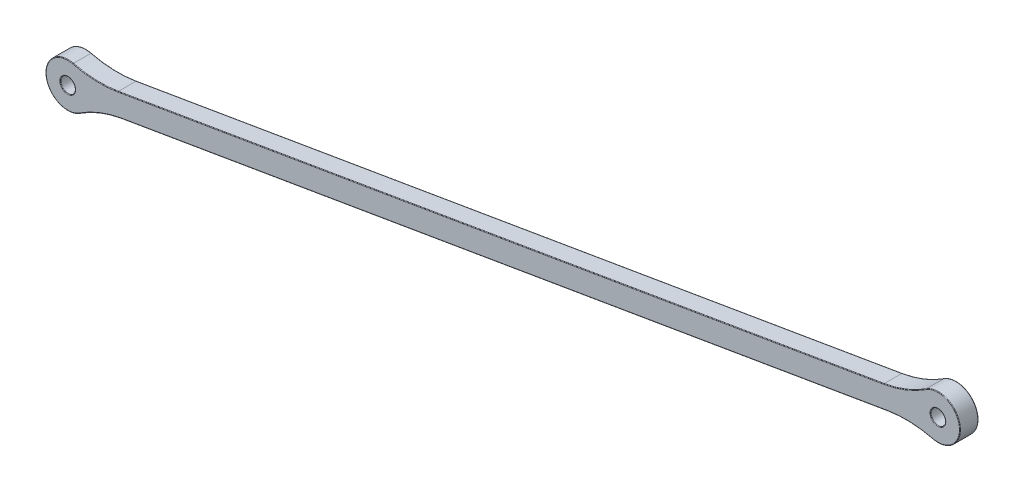
ISO-10303-21;
HEADER;
FILE_DESCRIPTION(('STEP AP214'),'2;1');
FILE_NAME('part.step','',(''),(''),'','','');
FILE_SCHEMA(('AUTOMOTIVE_DESIGN { 1 0 10303 214 1 1 1 1 }'));
ENDSEC;
DATA;
#1=APPLICATION_CONTEXT('core data for automotive mechanical design processes');
#2=APPLICATION_PROTOCOL_DEFINITION('international standard','automotive_design',2000,#1);
#3=PRODUCT_CONTEXT('',#1,'mechanical');
#4=PRODUCT('Part','Part','',(#3));
#5=PRODUCT_RELATED_PRODUCT_CATEGORY('part','',(#4));
#6=PRODUCT_DEFINITION_FORMATION('','',#4);
#7=PRODUCT_DEFINITION_CONTEXT('part definition',#1,'design');
#8=PRODUCT_DEFINITION('design','',#6,#7);
#9=PRODUCT_DEFINITION_SHAPE('','',#8);
#10=(LENGTH_UNIT() NAMED_UNIT(*) SI_UNIT(.MILLI.,.METRE.));
#11=(NAMED_UNIT(*) PLANE_ANGLE_UNIT() SI_UNIT($,.RADIAN.));
#12=(NAMED_UNIT(*) SI_UNIT($,.STERADIAN.) SOLID_ANGLE_UNIT());
#13=UNCERTAINTY_MEASURE_WITH_UNIT(LENGTH_MEASURE(1.E-05),#10,'distance_accuracy_value','');
#14=(GEOMETRIC_REPRESENTATION_CONTEXT(3) GLOBAL_UNCERTAINTY_ASSIGNED_CONTEXT((#13)) GLOBAL_UNIT_ASSIGNED_CONTEXT((#10,
#11,#12)) REPRESENTATION_CONTEXT('',''));
#15=CARTESIAN_POINT('',(0.,0.,0.));
#16=DIRECTION('',(0.,0.,1.));
#17=DIRECTION('',(1.,0.,0.));
#18=AXIS2_PLACEMENT_3D('',#15,#16,#17);
#19=CARTESIAN_POINT('',(-307.976278264637,263.097982683496,-5.));
#20=DIRECTION('',(0.,0.,1.));
#21=DIRECTION('',(1.,0.,0.));
#22=AXIS2_PLACEMENT_3D('',#19,#20,#21);
#23=CYLINDRICAL_SURFACE('',#22,5.99999999999999);
#24=DIRECTION('',(0.,0.,1.));
#25=VECTOR('',#24,1.);
#26=CARTESIAN_POINT('',(-304.692791597338,258.0761587812,-5.));
#27=LINE('',#26,#25);
#28=CARTESIAN_POINT('',(-304.692791597338,258.0761587812,-4.85));
#29=VERTEX_POINT('',#28);
#30=CARTESIAN_POINT('',(-304.692791597338,258.0761587812,-0.15));
#31=VERTEX_POINT('',#30);
#32=EDGE_CURVE('E345',#29,#31,#27,.T.);
#33=ORIENTED_EDGE('',*,*,#32,.T.);
#34=CARTESIAN_POINT('',(-307.976278264637,263.097982683496,-0.15));
#35=DIRECTION('',(0.,0.,1.));
#36=DIRECTION('',(1.,0.,0.));
#37=AXIS2_PLACEMENT_3D('',#34,#35,#36);
#38=CIRCLE('',#37,5.99999999999999);
#39=CARTESIAN_POINT('',(-306.531400647567,268.92141197144,-0.15));
#40=VERTEX_POINT('',#39);
#41=EDGE_CURVE('E219',#31,#40,#38,.F.);
#42=ORIENTED_EDGE('',*,*,#41,.T.);
#43=DIRECTION('',(0.,0.,1.));
#44=VECTOR('',#43,1.);
#45=CARTESIAN_POINT('',(-306.531400647567,268.92141197144,-5.));
#46=LINE('',#45,#44);
#47=CARTESIAN_POINT('',(-306.531400647567,268.92141197144,-4.85));
#48=VERTEX_POINT('',#47);
#49=EDGE_CURVE('E262',#40,#48,#46,.F.);
#50=ORIENTED_EDGE('',*,*,#49,.T.);
#51=CARTESIAN_POINT('',(-307.976278264637,263.097982683496,-4.85));
#52=DIRECTION('',(0.,0.,1.));
#53=DIRECTION('',(1.,0.,0.));
#54=AXIS2_PLACEMENT_3D('',#51,#52,#53);
#55=CIRCLE('',#54,5.99999999999999);
#56=EDGE_CURVE('E217',#48,#29,#55,.T.);
#57=ORIENTED_EDGE('',*,*,#56,.T.);
#58=EDGE_LOOP('',(#33,#42,#50,#57));
#59=FACE_BOUND('',#58,.T.);
#60=ADVANCED_FACE('F39',(#59),#23,.T.);
#61=CARTESIAN_POINT('',(-52.4628434174486,309.458293959367,-5.));
#62=DIRECTION('',(0.167146277293557,-0.985932108203656,0.));
#63=DIRECTION('',(0.985932108203656,0.167146277293557,0.));
#64=AXIS2_PLACEMENT_3D('',#61,#62,#63);
#65=PLANE('',#64);
#66=DIRECTION('',(0.,0.,1.));
#67=VECTOR('',#66,1.);
#68=CARTESIAN_POINT('',(-294.29262424341,268.460595165053,-5.));
#69=LINE('',#68,#67);
#70=CARTESIAN_POINT('',(-294.29262424341,268.460595165053,-4.85));
#71=VERTEX_POINT('',#70);
#72=CARTESIAN_POINT('',(-294.29262424341,268.460595165053,-0.15));
#73=VERTEX_POINT('',#72);
#74=EDGE_CURVE('E307',#71,#73,#69,.T.);
#75=ORIENTED_EDGE('',*,*,#74,.T.);
#76=DIRECTION('',(0.985932108203656,0.167146277293557,0.));
#77=VECTOR('',#76,1.);
#78=CARTESIAN_POINT('',(-86.0391039807482,303.766069401614,-0.15));
#79=LINE('',#78,#77);
#80=CARTESIAN_POINT('',(-86.0391039807482,303.766069401614,-0.15));
#81=VERTEX_POINT('',#80);
#82=EDGE_CURVE('E227',#73,#81,#79,.T.);
#83=ORIENTED_EDGE('',*,*,#82,.T.);
#84=DIRECTION('',(0.,0.,1.));
#85=VECTOR('',#84,1.);
#86=CARTESIAN_POINT('',(-86.0391039807482,303.766069401614,-5.));
#87=LINE('',#86,#85);
#88=CARTESIAN_POINT('',(-86.0391039807482,303.766069401614,-4.85));
#89=VERTEX_POINT('',#88);
#90=EDGE_CURVE('E299',#81,#89,#87,.F.);
#91=ORIENTED_EDGE('',*,*,#90,.T.);
#92=DIRECTION('',(0.985932108203656,0.167146277293557,0.));
#93=VECTOR('',#92,1.);
#94=CARTESIAN_POINT('',(-52.4628434174486,309.458293959367,-4.85));
#95=LINE('',#94,#93);
#96=EDGE_CURVE('E225',#89,#71,#95,.F.);
#97=ORIENTED_EDGE('',*,*,#96,.T.);
#98=EDGE_LOOP('',(#75,#83,#91,#97));
#99=FACE_BOUND('',#98,.T.);
#100=ADVANCED_FACE('F304',(#99),#65,.F.);
#101=CARTESIAN_POINT('',(-71.3525722957598,303.213089233949,-5.));
#102=DIRECTION('',(0.,0.,1.));
#103=DIRECTION('',(1.,0.,0.));
#104=AXIS2_PLACEMENT_3D('',#101,#102,#103);
#105=CYLINDRICAL_SURFACE('',#104,6.);
#106=DIRECTION('',(0.,0.,1.));
#107=VECTOR('',#106,1.);
#108=CARTESIAN_POINT('',(-74.636058963059,308.234913136245,-5.));
#109=LINE('',#108,#107);
#110=CARTESIAN_POINT('',(-74.636058963059,308.234913136245,-4.85));
#111=VERTEX_POINT('',#110);
#112=CARTESIAN_POINT('',(-74.636058963059,308.234913136245,-0.15));
#113=VERTEX_POINT('',#112);
#114=EDGE_CURVE('E301',#111,#113,#109,.T.);
#115=ORIENTED_EDGE('',*,*,#114,.T.);
#116=CARTESIAN_POINT('',(-71.3525722957598,303.213089233949,-0.15));
#117=DIRECTION('',(0.,0.,1.));
#118=DIRECTION('',(1.,0.,0.));
#119=AXIS2_PLACEMENT_3D('',#116,#117,#118);
#120=CIRCLE('',#119,6.);
#121=CARTESIAN_POINT('',(-72.7974499128298,297.389659946005,-0.15));
#122=VERTEX_POINT('',#121);
#123=EDGE_CURVE('E202',#113,#122,#120,.F.);
#124=ORIENTED_EDGE('',*,*,#123,.T.);
#125=DIRECTION('',(0.,0.,1.));
#126=VECTOR('',#125,1.);
#127=CARTESIAN_POINT('',(-72.7974499128298,297.389659946005,-5.));
#128=LINE('',#127,#126);
#129=CARTESIAN_POINT('',(-72.7974499128298,297.389659946005,-4.85));
#130=VERTEX_POINT('',#129);
#131=EDGE_CURVE('E311',#122,#130,#128,.F.);
#132=ORIENTED_EDGE('',*,*,#131,.T.);
#133=CARTESIAN_POINT('',(-71.3525722957598,303.213089233949,-4.85));
#134=DIRECTION('',(0.,0.,1.));
#135=DIRECTION('',(1.,0.,0.));
#136=AXIS2_PLACEMENT_3D('',#133,#134,#135);
#137=CIRCLE('',#136,6.);
#138=EDGE_CURVE('E200',#130,#111,#137,.T.);
#139=ORIENTED_EDGE('',*,*,#138,.T.);
#140=EDGE_LOOP('',(#115,#124,#132,#139));
#141=FACE_BOUND('',#140,.T.);
#142=ADVANCED_FACE('F336',(#141),#105,.T.);
#143=CARTESIAN_POINT('',(-307.976278264637,263.097982683496,-5.));
#144=DIRECTION('',(0.,0.,1.));
#145=DIRECTION('',(1.,0.,0.));
#146=AXIS2_PLACEMENT_3D('',#143,#144,#145);
#147=CYLINDRICAL_SURFACE('',#146,2.);
#148=CARTESIAN_POINT('',(-307.976278264637,263.097982683496,-0.15));
#149=DIRECTION('',(0.,0.,1.));
#150=DIRECTION('',(1.,0.,0.));
#151=AXIS2_PLACEMENT_3D('',#148,#149,#150);
#152=CIRCLE('',#151,2.);
#153=CARTESIAN_POINT('',(-305.976278264637,263.097982683496,-0.15));
#154=VERTEX_POINT('',#153);
#155=EDGE_CURVE('E194',#154,#154,#152,.T.);
#156=ORIENTED_EDGE('',*,*,#155,.T.);
#157=EDGE_LOOP('',(#156));
#158=FACE_BOUND('',#157,.T.);
#159=CARTESIAN_POINT('',(-307.976278264637,263.097982683496,-4.85));
#160=DIRECTION('',(0.,0.,1.));
#161=DIRECTION('',(1.,0.,0.));
#162=AXIS2_PLACEMENT_3D('',#159,#160,#161);
#163=CIRCLE('',#162,2.);
#164=CARTESIAN_POINT('',(-305.976278264637,263.097982683496,-4.85));
#165=VERTEX_POINT('',#164);
#166=EDGE_CURVE('E191',#165,#165,#163,.F.);
#167=ORIENTED_EDGE('',*,*,#166,.T.);
#168=EDGE_LOOP('',(#167));
#169=FACE_BOUND('',#168,.T.);
#170=ADVANCED_FACE('F643',(#158,#169),#147,.F.);
#171=CARTESIAN_POINT('',(-51.4599657536872,303.542701310145,-5.));
#172=DIRECTION('',(0.167146277293557,-0.985932108203656,0.));
#173=DIRECTION('',(0.985932108203656,0.167146277293557,0.));
#174=AXIS2_PLACEMENT_3D('',#171,#172,#173);
#175=PLANE('',#174);
#176=DIRECTION('',(0.,0.,-1.));
#177=VECTOR('',#176,1.);
#178=CARTESIAN_POINT('',(-85.0362263169865,297.850476752392,0.));
#179=LINE('',#178,#177);
#180=CARTESIAN_POINT('',(-85.0362263169865,297.850476752392,-4.85));
#181=VERTEX_POINT('',#180);
#182=CARTESIAN_POINT('',(-85.0362263169865,297.850476752392,-0.15));
#183=VERTEX_POINT('',#182);
#184=EDGE_CURVE('E340',#181,#183,#179,.F.);
#185=ORIENTED_EDGE('',*,*,#184,.T.);
#186=DIRECTION('',(0.985932108203656,0.167146277293557,0.));
#187=VECTOR('',#186,1.);
#188=CARTESIAN_POINT('',(-51.4599657536872,303.542701310145,-0.15));
#189=LINE('',#188,#187);
#190=CARTESIAN_POINT('',(-293.289746579649,262.545002515831,-0.15));
#191=VERTEX_POINT('',#190);
#192=EDGE_CURVE('E210',#183,#191,#189,.F.);
#193=ORIENTED_EDGE('',*,*,#192,.T.);
#194=DIRECTION('',(0.,0.,-1.));
#195=VECTOR('',#194,1.);
#196=CARTESIAN_POINT('',(-293.289746579649,262.545002515831,-5.));
#197=LINE('',#196,#195);
#198=CARTESIAN_POINT('',(-293.289746579649,262.545002515831,-4.85));
#199=VERTEX_POINT('',#198);
#200=EDGE_CURVE('E337',#191,#199,#197,.T.);
#201=ORIENTED_EDGE('',*,*,#200,.T.);
#202=DIRECTION('',(0.985932108203656,0.167146277293557,0.));
#203=VECTOR('',#202,1.);
#204=CARTESIAN_POINT('',(-85.0362263169865,297.850476752392,-4.85));
#205=LINE('',#204,#203);
#206=EDGE_CURVE('E208',#199,#181,#205,.T.);
#207=ORIENTED_EDGE('',*,*,#206,.T.);
#208=EDGE_LOOP('',(#185,#193,#201,#207));
#209=FACE_BOUND('',#208,.T.);
#210=ADVANCED_FACE('F375',(#209),#175,.T.);
#211=CARTESIAN_POINT('',(-71.3525722957598,303.213089233949,-5.));
#212=DIRECTION('',(0.,0.,1.));
#213=DIRECTION('',(1.,0.,0.));
#214=AXIS2_PLACEMENT_3D('',#211,#212,#213);
#215=CYLINDRICAL_SURFACE('',#214,2.);
#216=CARTESIAN_POINT('',(-71.3525722957598,303.213089233949,-0.15));
#217=DIRECTION('',(0.,0.,1.));
#218=DIRECTION('',(1.,0.,0.));
#219=AXIS2_PLACEMENT_3D('',#216,#217,#218);
#220=CIRCLE('',#219,2.);
#221=CARTESIAN_POINT('',(-69.3525722957598,303.213089233949,-0.15));
#222=VERTEX_POINT('',#221);
#223=EDGE_CURVE('E174',#222,#222,#220,.T.);
#224=ORIENTED_EDGE('',*,*,#223,.T.);
#225=EDGE_LOOP('',(#224));
#226=FACE_BOUND('',#225,.T.);
#227=CARTESIAN_POINT('',(-71.3525722957598,303.213089233949,-4.85));
#228=DIRECTION('',(0.,0.,1.));
#229=DIRECTION('',(1.,0.,0.));
#230=AXIS2_PLACEMENT_3D('',#227,#228,#229);
#231=CIRCLE('',#230,2.);
#232=CARTESIAN_POINT('',(-69.3525722957598,303.213089233949,-4.85));
#233=VERTEX_POINT('',#232);
#234=EDGE_CURVE('E306',#233,#233,#231,.F.);
#235=ORIENTED_EDGE('',*,*,#234,.T.);
#236=EDGE_LOOP('',(#235));
#237=FACE_BOUND('',#236,.T.);
#238=ADVANCED_FACE('F621',(#226,#237),#215,.F.);
#239=CARTESIAN_POINT('',(0.,0.,-5.));
#240=DIRECTION('',(0.,0.,1.));
#241=DIRECTION('',(1.,0.,0.));
#242=AXIS2_PLACEMENT_3D('',#239,#240,#241);
#243=PLANE('',#242);
#244=CARTESIAN_POINT('',(-71.3525722957598,303.213089233949,-5.));
#245=DIRECTION('',(0.,0.,1.));
#246=DIRECTION('',(1.,0.,0.));
#247=AXIS2_PLACEMENT_3D('',#244,#245,#246);
#248=CIRCLE('',#247,2.15);
#249=CARTESIAN_POINT('',(-69.2025722957598,303.213089233949,-5.));
#250=VERTEX_POINT('',#249);
#251=EDGE_CURVE('E11',#250,#250,#248,.T.);
#252=ORIENTED_EDGE('',*,*,#251,.T.);
#253=EDGE_LOOP('',(#252));
#254=FACE_BOUND('',#253,.T.);
#255=CARTESIAN_POINT('',(-307.976278264637,263.097982683496,-5.));
#256=DIRECTION('',(0.,0.,1.));
#257=DIRECTION('',(1.,0.,0.));
#258=AXIS2_PLACEMENT_3D('',#255,#256,#257);
#259=CIRCLE('',#258,2.15);
#260=CARTESIAN_POINT('',(-305.826278264637,263.097982683496,-5.));
#261=VERTEX_POINT('',#260);
#262=EDGE_CURVE('E48',#261,#261,#259,.T.);
#263=ORIENTED_EDGE('',*,*,#262,.T.);
#264=EDGE_LOOP('',(#263));
#265=FACE_BOUND('',#264,.T.);
#266=DIRECTION('',(0.985932108203656,0.167146277293557,0.));
#267=VECTOR('',#266,1.);
#268=CARTESIAN_POINT('',(-293.314818521243,262.692892332062,-5.));
#269=LINE('',#268,#267);
#270=CARTESIAN_POINT('',(-85.0612982585805,297.998366568622,-5.));
#271=VERTEX_POINT('',#270);
#272=CARTESIAN_POINT('',(-293.314818521243,262.692892332062,-5.));
#273=VERTEX_POINT('',#272);
#274=EDGE_CURVE('E56',#271,#273,#269,.F.);
#275=ORIENTED_EDGE('',*,*,#274,.T.);
#276=CARTESIAN_POINT('',(-288.275358260842,232.967039269721,-5.));
#277=DIRECTION('',(0.,0.,1.));
#278=DIRECTION('',(1.,0.,0.));
#279=AXIS2_PLACEMENT_3D('',#276,#277,#278);
#280=CIRCLE('',#279,30.15);
#281=CARTESIAN_POINT('',(-304.774878764021,258.201704378757,-5.));
#282=VERTEX_POINT('',#281);
#283=EDGE_CURVE('E241',#273,#282,#280,.T.);
#284=ORIENTED_EDGE('',*,*,#283,.T.);
#285=CARTESIAN_POINT('',(-307.976278264637,263.097982683496,-5.));
#286=DIRECTION('',(0.,0.,1.));
#287=DIRECTION('',(1.,0.,0.));
#288=AXIS2_PLACEMENT_3D('',#285,#286,#287);
#289=CIRCLE('',#288,5.84999999999999);
#290=CARTESIAN_POINT('',(-306.567522587994,268.775826239242,-5.));
#291=VERTEX_POINT('',#290);
#292=EDGE_CURVE('E229',#282,#291,#289,.F.);
#293=ORIENTED_EDGE('',*,*,#292,.T.);
#294=CARTESIAN_POINT('',(-299.307012562217,298.038558411163,-5.));
#295=DIRECTION('',(0.,0.,1.));
#296=DIRECTION('',(1.,0.,0.));
#297=AXIS2_PLACEMENT_3D('',#294,#295,#296);
#298=CIRCLE('',#297,30.15);
#299=CARTESIAN_POINT('',(-294.267552301816,268.312705348823,-5.));
#300=VERTEX_POINT('',#299);
#301=EDGE_CURVE('E231',#291,#300,#298,.T.);
#302=ORIENTED_EDGE('',*,*,#301,.T.);
#303=DIRECTION('',(0.985932108203656,0.167146277293557,0.));
#304=VECTOR('',#303,1.);
#305=CARTESIAN_POINT('',(-52.4377714758546,309.310404143136,-5.));
#306=LINE('',#305,#304);
#307=CARTESIAN_POINT('',(-86.0140320391542,303.618179585383,-5.));
#308=VERTEX_POINT('',#307);
#309=EDGE_CURVE('E233',#300,#308,#306,.T.);
#310=ORIENTED_EDGE('',*,*,#309,.T.);
#311=CARTESIAN_POINT('',(-91.0534922995549,333.344032647724,-5.));
#312=DIRECTION('',(0.,0.,1.));
#313=DIRECTION('',(1.,0.,0.));
#314=AXIS2_PLACEMENT_3D('',#311,#312,#313);
#315=CIRCLE('',#314,30.15);
#316=CARTESIAN_POINT('',(-74.5539717963765,308.109367538688,-5.));
#317=VERTEX_POINT('',#316);
#318=EDGE_CURVE('E235',#308,#317,#315,.T.);
#319=ORIENTED_EDGE('',*,*,#318,.T.);
#320=CARTESIAN_POINT('',(-71.3525722957598,303.213089233949,-5.));
#321=DIRECTION('',(0.,0.,1.));
#322=DIRECTION('',(1.,0.,0.));
#323=AXIS2_PLACEMENT_3D('',#320,#321,#322);
#324=CIRCLE('',#323,5.85);
#325=CARTESIAN_POINT('',(-72.761327972403,297.535245678204,-5.));
#326=VERTEX_POINT('',#325);
#327=EDGE_CURVE('E237',#317,#326,#324,.F.);
#328=ORIENTED_EDGE('',*,*,#327,.T.);
#329=CARTESIAN_POINT('',(-80.0218379981798,268.272513506282,-5.));
#330=DIRECTION('',(0.,0.,1.));
#331=DIRECTION('',(1.,0.,0.));
#332=AXIS2_PLACEMENT_3D('',#329,#330,#331);
#333=CIRCLE('',#332,30.15);
#334=EDGE_CURVE('E61',#326,#271,#333,.T.);
#335=ORIENTED_EDGE('',*,*,#334,.T.);
#336=EDGE_LOOP('',(#275,#284,#293,#302,#310,#319,#328,#335));
#337=FACE_BOUND('',#336,.T.);
#338=ADVANCED_FACE('F394',(#254,#265,#337),#243,.F.);
#339=CARTESIAN_POINT('',(0.,0.,0.));
#340=DIRECTION('',(0.,0.,1.));
#341=DIRECTION('',(1.,0.,0.));
#342=AXIS2_PLACEMENT_3D('',#339,#340,#341);
#343=PLANE('',#342);
#344=CARTESIAN_POINT('',(-71.3525722957598,303.213089233949,0.));
#345=DIRECTION('',(0.,0.,1.));
#346=DIRECTION('',(1.,0.,0.));
#347=AXIS2_PLACEMENT_3D('',#344,#345,#346);
#348=CIRCLE('',#347,2.15);
#349=CARTESIAN_POINT('',(-69.2025722957598,303.213089233949,0.));
#350=VERTEX_POINT('',#349);
#351=EDGE_CURVE('E183',#350,#350,#348,.F.);
#352=ORIENTED_EDGE('',*,*,#351,.T.);
#353=EDGE_LOOP('',(#352));
#354=FACE_BOUND('',#353,.T.);
#355=CARTESIAN_POINT('',(-307.976278264637,263.097982683496,0.));
#356=DIRECTION('',(0.,0.,1.));
#357=DIRECTION('',(1.,0.,0.));
#358=AXIS2_PLACEMENT_3D('',#355,#356,#357);
#359=CIRCLE('',#358,2.15);
#360=CARTESIAN_POINT('',(-305.826278264637,263.097982683496,0.));
#361=VERTEX_POINT('',#360);
#362=EDGE_CURVE('E180',#361,#361,#359,.F.);
#363=ORIENTED_EDGE('',*,*,#362,.T.);
#364=EDGE_LOOP('',(#363));
#365=FACE_BOUND('',#364,.T.);
#366=CARTESIAN_POINT('',(-71.3525722957598,303.213089233949,0.));
#367=DIRECTION('',(0.,0.,1.));
#368=DIRECTION('',(1.,0.,0.));
#369=AXIS2_PLACEMENT_3D('',#366,#367,#368);
#370=CIRCLE('',#369,5.85);
#371=CARTESIAN_POINT('',(-72.761327972403,297.535245678204,0.));
#372=VERTEX_POINT('',#371);
#373=CARTESIAN_POINT('',(-74.5539717963765,308.109367538688,0.));
#374=VERTEX_POINT('',#373);
#375=EDGE_CURVE('E178',#372,#374,#370,.T.);
#376=ORIENTED_EDGE('',*,*,#375,.T.);
#377=CARTESIAN_POINT('',(-91.0534922995549,333.344032647724,0.));
#378=DIRECTION('',(0.,0.,1.));
#379=DIRECTION('',(1.,0.,0.));
#380=AXIS2_PLACEMENT_3D('',#377,#378,#379);
#381=CIRCLE('',#380,30.15);
#382=CARTESIAN_POINT('',(-86.0140320391542,303.618179585383,0.));
#383=VERTEX_POINT('',#382);
#384=EDGE_CURVE('E159',#374,#383,#381,.F.);
#385=ORIENTED_EDGE('',*,*,#384,.T.);
#386=DIRECTION('',(0.985932108203656,0.167146277293557,0.));
#387=VECTOR('',#386,1.);
#388=CARTESIAN_POINT('',(-294.267552301816,268.312705348823,0.));
#389=LINE('',#388,#387);
#390=CARTESIAN_POINT('',(-294.267552301816,268.312705348823,0.));
#391=VERTEX_POINT('',#390);
#392=EDGE_CURVE('E167',#383,#391,#389,.F.);
#393=ORIENTED_EDGE('',*,*,#392,.T.);
#394=CARTESIAN_POINT('',(-299.307012562217,298.038558411163,0.));
#395=DIRECTION('',(0.,0.,1.));
#396=DIRECTION('',(1.,0.,0.));
#397=AXIS2_PLACEMENT_3D('',#394,#395,#396);
#398=CIRCLE('',#397,30.15);
#399=CARTESIAN_POINT('',(-306.567522587994,268.775826239242,0.));
#400=VERTEX_POINT('',#399);
#401=EDGE_CURVE('E173',#391,#400,#398,.F.);
#402=ORIENTED_EDGE('',*,*,#401,.T.);
#403=CARTESIAN_POINT('',(-307.976278264637,263.097982683496,0.));
#404=DIRECTION('',(0.,0.,1.));
#405=DIRECTION('',(1.,0.,0.));
#406=AXIS2_PLACEMENT_3D('',#403,#404,#405);
#407=CIRCLE('',#406,5.84999999999999);
#408=CARTESIAN_POINT('',(-304.774878764021,258.201704378757,0.));
#409=VERTEX_POINT('',#408);
#410=EDGE_CURVE('E318',#400,#409,#407,.T.);
#411=ORIENTED_EDGE('',*,*,#410,.T.);
#412=CARTESIAN_POINT('',(-288.275358260842,232.967039269721,0.));
#413=DIRECTION('',(0.,0.,1.));
#414=DIRECTION('',(1.,0.,0.));
#415=AXIS2_PLACEMENT_3D('',#412,#413,#414);
#416=CIRCLE('',#415,30.15);
#417=CARTESIAN_POINT('',(-293.314818521243,262.692892332062,0.));
#418=VERTEX_POINT('',#417);
#419=EDGE_CURVE('E320',#409,#418,#416,.F.);
#420=ORIENTED_EDGE('',*,*,#419,.T.);
#421=DIRECTION('',(0.985932108203656,0.167146277293557,0.));
#422=VECTOR('',#421,1.);
#423=CARTESIAN_POINT('',(-51.4850376952813,303.690591126375,0.));
#424=LINE('',#423,#422);
#425=CARTESIAN_POINT('',(-85.0612982585805,297.998366568622,0.));
#426=VERTEX_POINT('',#425);
#427=EDGE_CURVE('E322',#418,#426,#424,.T.);
#428=ORIENTED_EDGE('',*,*,#427,.T.);
#429=CARTESIAN_POINT('',(-80.0218379981798,268.272513506282,0.));
#430=DIRECTION('',(0.,0.,1.));
#431=DIRECTION('',(1.,0.,0.));
#432=AXIS2_PLACEMENT_3D('',#429,#430,#431);
#433=CIRCLE('',#432,30.15);
#434=EDGE_CURVE('E185',#426,#372,#433,.F.);
#435=ORIENTED_EDGE('',*,*,#434,.T.);
#436=EDGE_LOOP('',(#376,#385,#393,#402,#411,#420,#428,#435));
#437=FACE_BOUND('',#436,.T.);
#438=ADVANCED_FACE('F176',(#354,#365,#437),#343,.T.);
#439=CARTESIAN_POINT('',(-288.275358260842,232.967039269721,-5.));
#440=DIRECTION('',(0.,0.,1.));
#441=DIRECTION('',(1.,0.,0.));
#442=AXIS2_PLACEMENT_3D('',#439,#440,#441);
#443=CYLINDRICAL_SURFACE('',#442,30.);
#444=ORIENTED_EDGE('',*,*,#200,.F.);
#445=CARTESIAN_POINT('',(-288.275358260842,232.967039269721,-0.15));
#446=DIRECTION('',(0.,0.,1.));
#447=DIRECTION('',(1.,0.,0.));
#448=AXIS2_PLACEMENT_3D('',#445,#446,#447);
#449=CIRCLE('',#448,30.);
#450=EDGE_CURVE('E215',#191,#31,#449,.T.);
#451=ORIENTED_EDGE('',*,*,#450,.T.);
#452=ORIENTED_EDGE('',*,*,#32,.F.);
#453=CARTESIAN_POINT('',(-288.275358260842,232.967039269721,-4.85));
#454=DIRECTION('',(0.,0.,1.));
#455=DIRECTION('',(1.,0.,0.));
#456=AXIS2_PLACEMENT_3D('',#453,#454,#455);
#457=CIRCLE('',#456,30.);
#458=EDGE_CURVE('E212',#29,#199,#457,.F.);
#459=ORIENTED_EDGE('',*,*,#458,.T.);
#460=EDGE_LOOP('',(#444,#451,#452,#459));
#461=FACE_BOUND('',#460,.T.);
#462=ADVANCED_FACE('F372',(#461),#443,.F.);
#463=CARTESIAN_POINT('',(-80.0218379981798,268.272513506282,-5.));
#464=DIRECTION('',(0.,0.,1.));
#465=DIRECTION('',(1.,0.,0.));
#466=AXIS2_PLACEMENT_3D('',#463,#464,#465);
#467=CYLINDRICAL_SURFACE('',#466,30.);
#468=ORIENTED_EDGE('',*,*,#131,.F.);
#469=CARTESIAN_POINT('',(-80.0218379981798,268.272513506282,-0.15));
#470=DIRECTION('',(0.,0.,1.));
#471=DIRECTION('',(1.,0.,0.));
#472=AXIS2_PLACEMENT_3D('',#469,#470,#471);
#473=CIRCLE('',#472,30.);
#474=EDGE_CURVE('E206',#122,#183,#473,.T.);
#475=ORIENTED_EDGE('',*,*,#474,.T.);
#476=ORIENTED_EDGE('',*,*,#184,.F.);
#477=CARTESIAN_POINT('',(-80.0218379981798,268.272513506282,-4.85));
#478=DIRECTION('',(0.,0.,1.));
#479=DIRECTION('',(1.,0.,0.));
#480=AXIS2_PLACEMENT_3D('',#477,#478,#479);
#481=CIRCLE('',#480,30.);
#482=EDGE_CURVE('E204',#181,#130,#481,.F.);
#483=ORIENTED_EDGE('',*,*,#482,.T.);
#484=EDGE_LOOP('',(#468,#475,#476,#483));
#485=FACE_BOUND('',#484,.T.);
#486=ADVANCED_FACE('F419',(#485),#467,.F.);
#487=CARTESIAN_POINT('',(-91.0534922995549,333.344032647724,-5.));
#488=DIRECTION('',(0.,0.,1.));
#489=DIRECTION('',(1.,0.,0.));
#490=AXIS2_PLACEMENT_3D('',#487,#488,#489);
#491=CYLINDRICAL_SURFACE('',#490,30.);
#492=ORIENTED_EDGE('',*,*,#90,.F.);
#493=CARTESIAN_POINT('',(-91.0534922995549,333.344032647724,-0.15));
#494=DIRECTION('',(0.,0.,1.));
#495=DIRECTION('',(1.,0.,0.));
#496=AXIS2_PLACEMENT_3D('',#493,#494,#495);
#497=CIRCLE('',#496,30.);
#498=EDGE_CURVE('E161',#81,#113,#497,.T.);
#499=ORIENTED_EDGE('',*,*,#498,.T.);
#500=ORIENTED_EDGE('',*,*,#114,.F.);
#501=CARTESIAN_POINT('',(-91.0534922995549,333.344032647724,-4.85));
#502=DIRECTION('',(0.,0.,1.));
#503=DIRECTION('',(1.,0.,0.));
#504=AXIS2_PLACEMENT_3D('',#501,#502,#503);
#505=CIRCLE('',#504,30.);
#506=EDGE_CURVE('E197',#111,#89,#505,.F.);
#507=ORIENTED_EDGE('',*,*,#506,.T.);
#508=EDGE_LOOP('',(#492,#499,#500,#507));
#509=FACE_BOUND('',#508,.T.);
#510=ADVANCED_FACE('F298',(#509),#491,.F.);
#511=CARTESIAN_POINT('',(-299.307012562217,298.038558411163,-5.));
#512=DIRECTION('',(0.,0.,1.));
#513=DIRECTION('',(1.,0.,0.));
#514=AXIS2_PLACEMENT_3D('',#511,#512,#513);
#515=CYLINDRICAL_SURFACE('',#514,30.);
#516=ORIENTED_EDGE('',*,*,#49,.F.);
#517=CARTESIAN_POINT('',(-299.307012562217,298.038558411163,-0.15));
#518=DIRECTION('',(0.,0.,1.));
#519=DIRECTION('',(1.,0.,0.));
#520=AXIS2_PLACEMENT_3D('',#517,#518,#519);
#521=CIRCLE('',#520,30.);
#522=EDGE_CURVE('E223',#40,#73,#521,.T.);
#523=ORIENTED_EDGE('',*,*,#522,.T.);
#524=ORIENTED_EDGE('',*,*,#74,.F.);
#525=CARTESIAN_POINT('',(-299.307012562217,298.038558411163,-4.85));
#526=DIRECTION('',(0.,0.,1.));
#527=DIRECTION('',(1.,0.,0.));
#528=AXIS2_PLACEMENT_3D('',#525,#526,#527);
#529=CIRCLE('',#528,30.);
#530=EDGE_CURVE('E221',#71,#48,#529,.F.);
#531=ORIENTED_EDGE('',*,*,#530,.T.);
#532=EDGE_LOOP('',(#516,#523,#524,#531));
#533=FACE_BOUND('',#532,.T.);
#534=ADVANCED_FACE('F391',(#533),#515,.F.);
#535=CARTESIAN_POINT('',(-71.3525722957598,303.213089233949,-0.15));
#536=DIRECTION('',(0.,0.,1.));
#537=DIRECTION('',(1.,0.,0.));
#538=AXIS2_PLACEMENT_3D('',#535,#536,#537);
#539=TOROIDAL_SURFACE('',#538,2.15,0.15);
#540=ORIENTED_EDGE('',*,*,#351,.F.);
#541=EDGE_LOOP('',(#540));
#542=FACE_BOUND('',#541,.T.);
#543=ORIENTED_EDGE('',*,*,#223,.F.);
#544=EDGE_LOOP('',(#543));
#545=FACE_BOUND('',#544,.T.);
#546=ADVANCED_FACE('F427',(#542,#545),#539,.T.);
#547=CARTESIAN_POINT('',(-307.976278264637,263.097982683496,-0.15));
#548=DIRECTION('',(0.,0.,1.));
#549=DIRECTION('',(1.,0.,0.));
#550=AXIS2_PLACEMENT_3D('',#547,#548,#549);
#551=TOROIDAL_SURFACE('',#550,2.15,0.15);
#552=ORIENTED_EDGE('',*,*,#362,.F.);
#553=EDGE_LOOP('',(#552));
#554=FACE_BOUND('',#553,.T.);
#555=ORIENTED_EDGE('',*,*,#155,.F.);
#556=EDGE_LOOP('',(#555));
#557=FACE_BOUND('',#556,.T.);
#558=ADVANCED_FACE('F430',(#554,#557),#551,.T.);
#559=CARTESIAN_POINT('',(-288.275358260842,232.967039269721,-0.15));
#560=DIRECTION('',(0.,0.,1.));
#561=DIRECTION('',(1.,0.,0.));
#562=AXIS2_PLACEMENT_3D('',#559,#560,#561);
#563=TOROIDAL_SURFACE('',#562,30.15,0.15);
#564=CARTESIAN_POINT('',(-304.774878764021,258.201704378757,-0.15));
#565=DIRECTION('',(-0.836970650382705,-0.547247777883065,0.));
#566=DIRECTION('',(0.547247777883065,-0.836970650382705,0.));
#567=AXIS2_PLACEMENT_3D('',#564,#565,#566);
#568=CIRCLE('',#567,0.15);
#569=EDGE_CURVE('E256',#31,#409,#568,.T.);
#570=ORIENTED_EDGE('',*,*,#569,.F.);
#571=ORIENTED_EDGE('',*,*,#450,.F.);
#572=CARTESIAN_POINT('',(-293.314818521243,262.692892332062,-0.15));
#573=DIRECTION('',(0.985932108203677,0.167146277293431,0.));
#574=DIRECTION('',(-0.167146277293431,0.985932108203677,0.));
#575=AXIS2_PLACEMENT_3D('',#572,#573,#574);
#576=CIRCLE('',#575,0.15);
#577=EDGE_CURVE('E259',#418,#191,#576,.T.);
#578=ORIENTED_EDGE('',*,*,#577,.F.);
#579=ORIENTED_EDGE('',*,*,#419,.F.);
#580=EDGE_LOOP('',(#570,#571,#578,#579));
#581=FACE_BOUND('',#580,.T.);
#582=ADVANCED_FACE('F384',(#581),#563,.T.);
#583=CARTESIAN_POINT('',(-51.4850376952813,303.690591126375,-0.15));
#584=DIRECTION('',(0.985932108203656,0.167146277293557,0.));
#585=DIRECTION('',(-0.167146277293557,0.985932108203656,0.));
#586=AXIS2_PLACEMENT_3D('',#583,#584,#585);
#587=CYLINDRICAL_SURFACE('',#586,0.15);
#588=ORIENTED_EDGE('',*,*,#577,.T.);
#589=ORIENTED_EDGE('',*,*,#192,.F.);
#590=CARTESIAN_POINT('',(-85.0612982585805,297.998366568622,-0.15));
#591=DIRECTION('',(0.985932108203647,0.167146277293611,0.));
#592=DIRECTION('',(-0.167146277293611,0.985932108203647,0.));
#593=AXIS2_PLACEMENT_3D('',#590,#591,#592);
#594=CIRCLE('',#593,0.15);
#595=EDGE_CURVE('E253',#426,#183,#594,.T.);
#596=ORIENTED_EDGE('',*,*,#595,.F.);
#597=ORIENTED_EDGE('',*,*,#427,.F.);
#598=EDGE_LOOP('',(#588,#589,#596,#597));
#599=FACE_BOUND('',#598,.T.);
#600=ADVANCED_FACE('F379',(#599),#587,.T.);
#601=CARTESIAN_POINT('',(-307.976278264637,263.097982683496,-0.15));
#602=DIRECTION('',(0.,0.,1.));
#603=DIRECTION('',(1.,0.,0.));
#604=AXIS2_PLACEMENT_3D('',#601,#602,#603);
#605=TOROIDAL_SURFACE('',#604,5.84999999999999,0.15);
#606=ORIENTED_EDGE('',*,*,#569,.T.);
#607=ORIENTED_EDGE('',*,*,#410,.F.);
#608=CARTESIAN_POINT('',(-306.567522587994,268.775826239242,-0.15));
#609=DIRECTION('',(0.970571547990785,-0.240812936178209,0.));
#610=DIRECTION('',(0.240812936178209,0.970571547990786,0.));
#611=AXIS2_PLACEMENT_3D('',#608,#609,#610);
#612=CIRCLE('',#611,0.15);
#613=EDGE_CURVE('E250',#40,#400,#612,.T.);
#614=ORIENTED_EDGE('',*,*,#613,.F.);
#615=ORIENTED_EDGE('',*,*,#41,.F.);
#616=EDGE_LOOP('',(#606,#607,#614,#615));
#617=FACE_BOUND('',#616,.T.);
#618=ADVANCED_FACE('F387',(#617),#605,.T.);
#619=CARTESIAN_POINT('',(-80.0218379981798,268.272513506282,-0.15));
#620=DIRECTION('',(0.,0.,1.));
#621=DIRECTION('',(1.,0.,0.));
#622=AXIS2_PLACEMENT_3D('',#619,#620,#621);
#623=TOROIDAL_SURFACE('',#622,30.15,0.15);
#624=ORIENTED_EDGE('',*,*,#595,.T.);
#625=ORIENTED_EDGE('',*,*,#474,.F.);
#626=CARTESIAN_POINT('',(-72.761327972403,297.535245678204,-0.15));
#627=DIRECTION('',(0.970571547990764,-0.240812936178296,0.));
#628=DIRECTION('',(0.240812936178296,0.970571547990764,0.));
#629=AXIS2_PLACEMENT_3D('',#626,#627,#628);
#630=CIRCLE('',#629,0.15);
#631=EDGE_CURVE('E247',#372,#122,#630,.T.);
#632=ORIENTED_EDGE('',*,*,#631,.F.);
#633=ORIENTED_EDGE('',*,*,#434,.F.);
#634=EDGE_LOOP('',(#624,#625,#632,#633));
#635=FACE_BOUND('',#634,.T.);
#636=ADVANCED_FACE('F329',(#635),#623,.T.);
#637=CARTESIAN_POINT('',(-299.307012562217,298.038558411163,-0.15));
#638=DIRECTION('',(0.,0.,1.));
#639=DIRECTION('',(1.,0.,0.));
#640=AXIS2_PLACEMENT_3D('',#637,#638,#639);
#641=TOROIDAL_SURFACE('',#640,30.15,0.15);
#642=ORIENTED_EDGE('',*,*,#613,.T.);
#643=ORIENTED_EDGE('',*,*,#401,.F.);
#644=CARTESIAN_POINT('',(-294.267552301816,268.312705348823,-0.15));
#645=DIRECTION('',(0.985932108203677,0.167146277293431,0.));
#646=DIRECTION('',(-0.167146277293431,0.985932108203677,0.));
#647=AXIS2_PLACEMENT_3D('',#644,#645,#646);
#648=CIRCLE('',#647,0.15);
#649=EDGE_CURVE('E170',#73,#391,#648,.T.);
#650=ORIENTED_EDGE('',*,*,#649,.F.);
#651=ORIENTED_EDGE('',*,*,#522,.F.);
#652=EDGE_LOOP('',(#642,#643,#650,#651));
#653=FACE_BOUND('',#652,.T.);
#654=ADVANCED_FACE('F390',(#653),#641,.T.);
#655=CARTESIAN_POINT('',(-71.3525722957598,303.213089233949,-0.15));
#656=DIRECTION('',(0.,0.,1.));
#657=DIRECTION('',(1.,0.,0.));
#658=AXIS2_PLACEMENT_3D('',#655,#656,#657);
#659=TOROIDAL_SURFACE('',#658,5.85,0.15);
#660=ORIENTED_EDGE('',*,*,#631,.T.);
#661=ORIENTED_EDGE('',*,*,#123,.F.);
#662=CARTESIAN_POINT('',(-74.5539717963765,308.109367538688,-0.15));
#663=DIRECTION('',(-0.83697065038262,-0.547247777883194,0.));
#664=DIRECTION('',(0.547247777883194,-0.83697065038262,0.));
#665=AXIS2_PLACEMENT_3D('',#662,#663,#664);
#666=CIRCLE('',#665,0.15);
#667=EDGE_CURVE('E164',#374,#113,#666,.T.);
#668=ORIENTED_EDGE('',*,*,#667,.F.);
#669=ORIENTED_EDGE('',*,*,#375,.F.);
#670=EDGE_LOOP('',(#660,#661,#668,#669));
#671=FACE_BOUND('',#670,.T.);
#672=ADVANCED_FACE('F332',(#671),#659,.T.);
#673=CARTESIAN_POINT('',(-52.4377714758546,309.310404143136,-0.15));
#674=DIRECTION('',(-0.985932108203656,-0.167146277293557,0.));
#675=DIRECTION('',(0.167146277293557,-0.985932108203656,0.));
#676=AXIS2_PLACEMENT_3D('',#673,#674,#675);
#677=CYLINDRICAL_SURFACE('',#676,0.15);
#678=ORIENTED_EDGE('',*,*,#649,.T.);
#679=ORIENTED_EDGE('',*,*,#392,.F.);
#680=CARTESIAN_POINT('',(-86.0140320391542,303.618179585383,-0.15));
#681=DIRECTION('',(0.985932108203647,0.167146277293611,0.));
#682=DIRECTION('',(-0.167146277293611,0.985932108203647,0.));
#683=AXIS2_PLACEMENT_3D('',#680,#681,#682);
#684=CIRCLE('',#683,0.15);
#685=EDGE_CURVE('E155',#81,#383,#684,.T.);
#686=ORIENTED_EDGE('',*,*,#685,.F.);
#687=ORIENTED_EDGE('',*,*,#82,.F.);
#688=EDGE_LOOP('',(#678,#679,#686,#687));
#689=FACE_BOUND('',#688,.T.);
#690=ADVANCED_FACE('F168',(#689),#677,.T.);
#691=CARTESIAN_POINT('',(-91.0534922995549,333.344032647724,-0.15));
#692=DIRECTION('',(0.,0.,1.));
#693=DIRECTION('',(1.,0.,0.));
#694=AXIS2_PLACEMENT_3D('',#691,#692,#693);
#695=TOROIDAL_SURFACE('',#694,30.15,0.15);
#696=ORIENTED_EDGE('',*,*,#667,.T.);
#697=ORIENTED_EDGE('',*,*,#498,.F.);
#698=ORIENTED_EDGE('',*,*,#685,.T.);
#699=ORIENTED_EDGE('',*,*,#384,.F.);
#700=EDGE_LOOP('',(#696,#697,#698,#699));
#701=FACE_BOUND('',#700,.T.);
#702=ADVANCED_FACE('F157',(#701),#695,.T.);
#703=CARTESIAN_POINT('',(-71.3525722957598,303.213089233949,-4.85));
#704=DIRECTION('',(0.,0.,1.));
#705=DIRECTION('',(1.,0.,0.));
#706=AXIS2_PLACEMENT_3D('',#703,#704,#705);
#707=TOROIDAL_SURFACE('',#706,2.15,0.15);
#708=ORIENTED_EDGE('',*,*,#234,.F.);
#709=EDGE_LOOP('',(#708));
#710=FACE_BOUND('',#709,.T.);
#711=ORIENTED_EDGE('',*,*,#251,.F.);
#712=EDGE_LOOP('',(#711));
#713=FACE_BOUND('',#712,.T.);
#714=ADVANCED_FACE('F437',(#710,#713),#707,.T.);
#715=CARTESIAN_POINT('',(-307.976278264637,263.097982683496,-4.85));
#716=DIRECTION('',(0.,0.,1.));
#717=DIRECTION('',(1.,0.,0.));
#718=AXIS2_PLACEMENT_3D('',#715,#716,#717);
#719=TOROIDAL_SURFACE('',#718,2.15,0.15);
#720=ORIENTED_EDGE('',*,*,#166,.F.);
#721=EDGE_LOOP('',(#720));
#722=FACE_BOUND('',#721,.T.);
#723=ORIENTED_EDGE('',*,*,#262,.F.);
#724=EDGE_LOOP('',(#723));
#725=FACE_BOUND('',#724,.T.);
#726=ADVANCED_FACE('F454',(#722,#725),#719,.T.);
#727=CARTESIAN_POINT('',(-91.0534922995549,333.344032647724,-4.85));
#728=DIRECTION('',(0.,0.,1.));
#729=DIRECTION('',(1.,0.,0.));
#730=AXIS2_PLACEMENT_3D('',#727,#728,#729);
#731=TOROIDAL_SURFACE('',#730,30.15,0.15);
#732=CARTESIAN_POINT('',(-86.0140320391542,303.618179585383,-4.85));
#733=DIRECTION('',(-0.985932108203647,-0.167146277293611,0.));
#734=DIRECTION('',(0.167146277293611,-0.985932108203647,0.));
#735=AXIS2_PLACEMENT_3D('',#732,#733,#734);
#736=CIRCLE('',#735,0.15);
#737=EDGE_CURVE('E278',#89,#308,#736,.T.);
#738=ORIENTED_EDGE('',*,*,#737,.F.);
#739=ORIENTED_EDGE('',*,*,#506,.F.);
#740=CARTESIAN_POINT('',(-74.5539717963765,308.109367538688,-4.85));
#741=DIRECTION('',(0.83697065038262,0.547247777883194,0.));
#742=DIRECTION('',(-0.547247777883194,0.83697065038262,0.));
#743=AXIS2_PLACEMENT_3D('',#740,#741,#742);
#744=CIRCLE('',#743,0.15);
#745=EDGE_CURVE('E43',#317,#111,#744,.T.);
#746=ORIENTED_EDGE('',*,*,#745,.F.);
#747=ORIENTED_EDGE('',*,*,#318,.F.);
#748=EDGE_LOOP('',(#738,#739,#746,#747));
#749=FACE_BOUND('',#748,.T.);
#750=ADVANCED_FACE('F41',(#749),#731,.T.);
#751=CARTESIAN_POINT('',(-71.3525722957598,303.213089233949,-4.85));
#752=DIRECTION('',(0.,0.,1.));
#753=DIRECTION('',(1.,0.,0.));
#754=AXIS2_PLACEMENT_3D('',#751,#752,#753);
#755=TOROIDAL_SURFACE('',#754,5.85,0.15);
#756=ORIENTED_EDGE('',*,*,#745,.T.);
#757=ORIENTED_EDGE('',*,*,#138,.F.);
#758=CARTESIAN_POINT('',(-72.761327972403,297.535245678204,-4.85));
#759=DIRECTION('',(-0.970571547990764,0.240812936178296,0.));
#760=DIRECTION('',(-0.240812936178296,-0.970571547990764,0.));
#761=AXIS2_PLACEMENT_3D('',#758,#759,#760);
#762=CIRCLE('',#761,0.15);
#763=EDGE_CURVE('E276',#326,#130,#762,.T.);
#764=ORIENTED_EDGE('',*,*,#763,.F.);
#765=ORIENTED_EDGE('',*,*,#327,.F.);
#766=EDGE_LOOP('',(#756,#757,#764,#765));
#767=FACE_BOUND('',#766,.T.);
#768=ADVANCED_FACE('F289',(#767),#755,.T.);
#769=CARTESIAN_POINT('',(-52.4377714758546,309.310404143136,-4.85));
#770=DIRECTION('',(0.985932108203656,0.167146277293557,0.));
#771=DIRECTION('',(-0.167146277293557,0.985932108203656,0.));
#772=AXIS2_PLACEMENT_3D('',#769,#770,#771);
#773=CYLINDRICAL_SURFACE('',#772,0.15);
#774=ORIENTED_EDGE('',*,*,#737,.T.);
#775=ORIENTED_EDGE('',*,*,#309,.F.);
#776=CARTESIAN_POINT('',(-294.267552301816,268.312705348823,-4.85));
#777=DIRECTION('',(-0.985932108203677,-0.167146277293431,0.));
#778=DIRECTION('',(0.167146277293431,-0.985932108203677,0.));
#779=AXIS2_PLACEMENT_3D('',#776,#777,#778);
#780=CIRCLE('',#779,0.15);
#781=EDGE_CURVE('E273',#71,#300,#780,.T.);
#782=ORIENTED_EDGE('',*,*,#781,.F.);
#783=ORIENTED_EDGE('',*,*,#96,.F.);
#784=EDGE_LOOP('',(#774,#775,#782,#783));
#785=FACE_BOUND('',#784,.T.);
#786=ADVANCED_FACE('F393',(#785),#773,.T.);
#787=CARTESIAN_POINT('',(-80.0218379981798,268.272513506282,-4.85));
#788=DIRECTION('',(0.,0.,1.));
#789=DIRECTION('',(1.,0.,0.));
#790=AXIS2_PLACEMENT_3D('',#787,#788,#789);
#791=TOROIDAL_SURFACE('',#790,30.15,0.15);
#792=ORIENTED_EDGE('',*,*,#763,.T.);
#793=ORIENTED_EDGE('',*,*,#482,.F.);
#794=CARTESIAN_POINT('',(-85.0612982585805,297.998366568622,-4.85));
#795=DIRECTION('',(-0.985932108203647,-0.167146277293611,0.));
#796=DIRECTION('',(0.167146277293611,-0.985932108203647,0.));
#797=AXIS2_PLACEMENT_3D('',#794,#795,#796);
#798=CIRCLE('',#797,0.15);
#799=EDGE_CURVE('E270',#271,#181,#798,.T.);
#800=ORIENTED_EDGE('',*,*,#799,.F.);
#801=ORIENTED_EDGE('',*,*,#334,.F.);
#802=EDGE_LOOP('',(#792,#793,#800,#801));
#803=FACE_BOUND('',#802,.T.);
#804=ADVANCED_FACE('F397',(#803),#791,.T.);
#805=CARTESIAN_POINT('',(-299.307012562217,298.038558411163,-4.85));
#806=DIRECTION('',(0.,0.,1.));
#807=DIRECTION('',(1.,0.,0.));
#808=AXIS2_PLACEMENT_3D('',#805,#806,#807);
#809=TOROIDAL_SURFACE('',#808,30.15,0.15);
#810=ORIENTED_EDGE('',*,*,#781,.T.);
#811=ORIENTED_EDGE('',*,*,#301,.F.);
#812=CARTESIAN_POINT('',(-306.567522587994,268.775826239242,-4.85));
#813=DIRECTION('',(-0.970571547990785,0.240812936178209,0.));
#814=DIRECTION('',(-0.240812936178209,-0.970571547990786,0.));
#815=AXIS2_PLACEMENT_3D('',#812,#813,#814);
#816=CIRCLE('',#815,0.15);
#817=EDGE_CURVE('E267',#48,#291,#816,.T.);
#818=ORIENTED_EDGE('',*,*,#817,.F.);
#819=ORIENTED_EDGE('',*,*,#530,.F.);
#820=EDGE_LOOP('',(#810,#811,#818,#819));
#821=FACE_BOUND('',#820,.T.);
#822=ADVANCED_FACE('F360',(#821),#809,.T.);
#823=CARTESIAN_POINT('',(-51.4850376952813,303.690591126375,-4.85));
#824=DIRECTION('',(-0.985932108203656,-0.167146277293557,0.));
#825=DIRECTION('',(0.167146277293557,-0.985932108203656,0.));
#826=AXIS2_PLACEMENT_3D('',#823,#824,#825);
#827=CYLINDRICAL_SURFACE('',#826,0.15);
#828=ORIENTED_EDGE('',*,*,#799,.T.);
#829=ORIENTED_EDGE('',*,*,#206,.F.);
#830=CARTESIAN_POINT('',(-293.314818521243,262.692892332062,-4.85));
#831=DIRECTION('',(-0.985932108203677,-0.167146277293431,0.));
#832=DIRECTION('',(0.167146277293431,-0.985932108203677,0.));
#833=AXIS2_PLACEMENT_3D('',#830,#831,#832);
#834=CIRCLE('',#833,0.15);
#835=EDGE_CURVE('E265',#273,#199,#834,.T.);
#836=ORIENTED_EDGE('',*,*,#835,.F.);
#837=ORIENTED_EDGE('',*,*,#274,.F.);
#838=EDGE_LOOP('',(#828,#829,#836,#837));
#839=FACE_BOUND('',#838,.T.);
#840=ADVANCED_FACE('F399',(#839),#827,.T.);
#841=CARTESIAN_POINT('',(-307.976278264637,263.097982683496,-4.85));
#842=DIRECTION('',(0.,0.,1.));
#843=DIRECTION('',(1.,0.,0.));
#844=AXIS2_PLACEMENT_3D('',#841,#842,#843);
#845=TOROIDAL_SURFACE('',#844,5.84999999999999,0.15);
#846=ORIENTED_EDGE('',*,*,#817,.T.);
#847=ORIENTED_EDGE('',*,*,#292,.F.);
#848=CARTESIAN_POINT('',(-304.774878764021,258.201704378757,-4.85));
#849=DIRECTION('',(0.836970650382705,0.547247777883065,0.));
#850=DIRECTION('',(-0.547247777883065,0.836970650382705,0.));
#851=AXIS2_PLACEMENT_3D('',#848,#849,#850);
#852=CIRCLE('',#851,0.15);
#853=EDGE_CURVE('E263',#29,#282,#852,.T.);
#854=ORIENTED_EDGE('',*,*,#853,.F.);
#855=ORIENTED_EDGE('',*,*,#56,.F.);
#856=EDGE_LOOP('',(#846,#847,#854,#855));
#857=FACE_BOUND('',#856,.T.);
#858=ADVANCED_FACE('F364',(#857),#845,.T.);
#859=CARTESIAN_POINT('',(-288.275358260842,232.967039269721,-4.85));
#860=DIRECTION('',(0.,0.,1.));
#861=DIRECTION('',(1.,0.,0.));
#862=AXIS2_PLACEMENT_3D('',#859,#860,#861);
#863=TOROIDAL_SURFACE('',#862,30.15,0.15);
#864=ORIENTED_EDGE('',*,*,#835,.T.);
#865=ORIENTED_EDGE('',*,*,#458,.F.);
#866=ORIENTED_EDGE('',*,*,#853,.T.);
#867=ORIENTED_EDGE('',*,*,#283,.F.);
#868=EDGE_LOOP('',(#864,#865,#866,#867));
#869=FACE_BOUND('',#868,.T.);
#870=ADVANCED_FACE('F368',(#869),#863,.T.);
#871=CLOSED_SHELL('',(#60,#100,#142,#170,#210,#238,#338,#438,#462,#486,#510,#534,#546,#558,#582,
#600,#618,#636,#654,#672,#690,#702,#714,#726,#750,#768,#786,#804,#822,#840,#858,#870));
#872=MANIFOLD_SOLID_BREP('B2',#871);
#873=ADVANCED_BREP_SHAPE_REPRESENTATION('',(#18,#872),#14);
#874=SHAPE_DEFINITION_REPRESENTATION(#9,#873);
ENDSEC;
END-ISO-10303-21;
